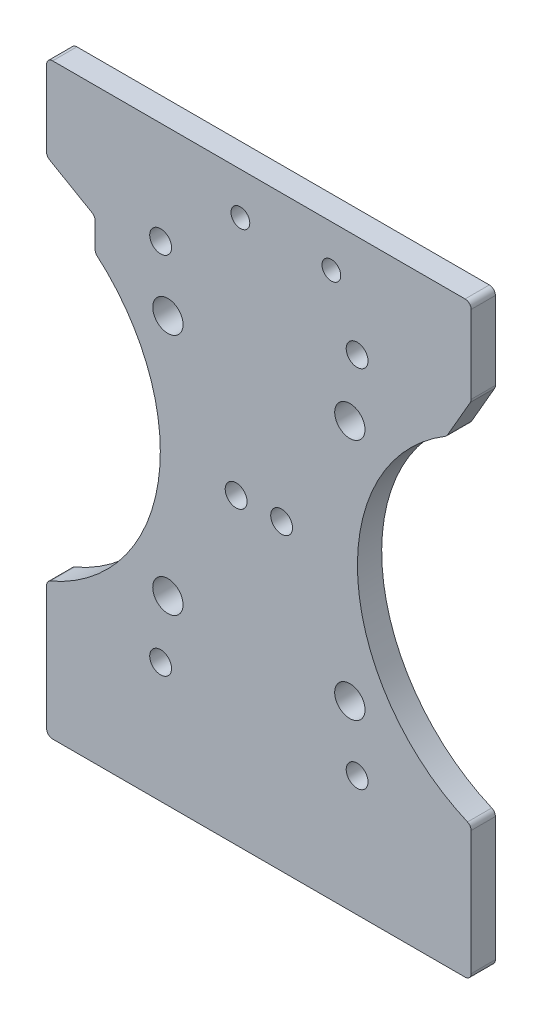
ISO-10303-21;
HEADER;
FILE_DESCRIPTION(('STEP AP214'),'2;1');
FILE_NAME('part.step','',(''),(''),'','','');
FILE_SCHEMA(('AUTOMOTIVE_DESIGN { 1 0 10303 214 1 1 1 1 }'));
ENDSEC;
DATA;
#1=APPLICATION_CONTEXT('core data for automotive mechanical design processes');
#2=APPLICATION_PROTOCOL_DEFINITION('international standard','automotive_design',2000,#1);
#3=PRODUCT_CONTEXT('',#1,'mechanical');
#4=PRODUCT('Part','Part','',(#3));
#5=PRODUCT_RELATED_PRODUCT_CATEGORY('part','',(#4));
#6=PRODUCT_DEFINITION_FORMATION('','',#4);
#7=PRODUCT_DEFINITION_CONTEXT('part definition',#1,'design');
#8=PRODUCT_DEFINITION('design','',#6,#7);
#9=PRODUCT_DEFINITION_SHAPE('','',#8);
#10=(LENGTH_UNIT() NAMED_UNIT(*) SI_UNIT(.MILLI.,.METRE.));
#11=(NAMED_UNIT(*) PLANE_ANGLE_UNIT() SI_UNIT($,.RADIAN.));
#12=(NAMED_UNIT(*) SI_UNIT($,.STERADIAN.) SOLID_ANGLE_UNIT());
#13=UNCERTAINTY_MEASURE_WITH_UNIT(LENGTH_MEASURE(1.E-05),#10,'distance_accuracy_value','');
#14=(GEOMETRIC_REPRESENTATION_CONTEXT(3) GLOBAL_UNCERTAINTY_ASSIGNED_CONTEXT((#13)) GLOBAL_UNIT_ASSIGNED_CONTEXT((#10,
#11,#12)) REPRESENTATION_CONTEXT('',''));
#15=CARTESIAN_POINT('',(0.,0.,0.));
#16=DIRECTION('',(0.,0.,1.));
#17=DIRECTION('',(1.,0.,0.));
#18=AXIS2_PLACEMENT_3D('',#15,#16,#17);
#19=CARTESIAN_POINT('',(46.25,0.,4.));
#20=DIRECTION('',(0.,0.,-1.));
#21=DIRECTION('',(-1.,0.,0.));
#22=AXIS2_PLACEMENT_3D('',#19,#20,#21);
#23=CYLINDRICAL_SURFACE('',#22,30.);
#24=CARTESIAN_POINT('',(46.25,0.,4.));
#25=DIRECTION('',(0.,0.,1.));
#26=DIRECTION('',(1.,0.,0.));
#27=AXIS2_PLACEMENT_3D('',#24,#25,#26);
#28=CIRCLE('',#27,30.);
#29=CARTESIAN_POINT('',(30.7389788384187,25.6789451209542,4.));
#30=VERTEX_POINT('',#29);
#31=CARTESIAN_POINT('',(34.3951612903231,-27.5583526207127,4.));
#32=VERTEX_POINT('',#31);
#33=EDGE_CURVE('E419',#30,#32,#28,.T.);
#34=ORIENTED_EDGE('',*,*,#33,.T.);
#35=DIRECTION('',(0.,0.,-1.));
#36=VECTOR('',#35,1.);
#37=CARTESIAN_POINT('',(34.3951612903231,-27.5583526207127,4.));
#38=LINE('',#37,#36);
#39=CARTESIAN_POINT('',(34.3951612903231,-27.5583526207127,0.));
#40=VERTEX_POINT('',#39);
#41=EDGE_CURVE('E210',#32,#40,#38,.T.);
#42=ORIENTED_EDGE('',*,*,#41,.T.);
#43=CARTESIAN_POINT('',(46.25,0.,0.));
#44=DIRECTION('',(0.,0.,1.));
#45=DIRECTION('',(1.,0.,0.));
#46=AXIS2_PLACEMENT_3D('',#43,#44,#45);
#47=CIRCLE('',#46,30.);
#48=CARTESIAN_POINT('',(30.7389788384187,25.6789451209542,0.));
#49=VERTEX_POINT('',#48);
#50=EDGE_CURVE('E194',#49,#40,#47,.T.);
#51=ORIENTED_EDGE('',*,*,#50,.F.);
#52=DIRECTION('',(0.,0.,-1.));
#53=VECTOR('',#52,1.);
#54=CARTESIAN_POINT('',(30.7389788384187,25.6789451209542,4.));
#55=LINE('',#54,#53);
#56=EDGE_CURVE('E207',#49,#30,#55,.F.);
#57=ORIENTED_EDGE('',*,*,#56,.T.);
#58=EDGE_LOOP('',(#34,#42,#51,#57));
#59=FACE_BOUND('',#58,.T.);
#60=ADVANCED_FACE('F40',(#59),#23,.F.);
#61=CARTESIAN_POINT('',(12.0425309480404,-6.9527584845755,4.));
#62=DIRECTION('',(0.866025403784439,-0.499999999999999,0.));
#63=DIRECTION('',(0.499999999999999,0.86602540378444,0.));
#64=AXIS2_PLACEMENT_3D('',#61,#62,#63);
#65=PLANE('',#64);
#66=DIRECTION('',(-0.499999999999999,-0.86602540378444,0.));
#67=VECTOR('',#66,1.);
#68=CARTESIAN_POINT('',(12.0425309480404,-6.9527584845755,4.));
#69=LINE('',#68,#67);
#70=CARTESIAN_POINT('',(34.8660254037845,32.57869351904,4.));
#71=VERTEX_POINT('',#70);
#72=CARTESIAN_POINT('',(31.0879702034838,26.0349099583193,4.));
#73=VERTEX_POINT('',#72);
#74=EDGE_CURVE('E421',#71,#73,#69,.T.);
#75=ORIENTED_EDGE('',*,*,#74,.T.);
#76=DIRECTION('',(0.,0.,-1.));
#77=VECTOR('',#76,1.);
#78=CARTESIAN_POINT('',(31.0879702034838,26.0349099583193,4.));
#79=LINE('',#78,#77);
#80=CARTESIAN_POINT('',(31.0879702034838,26.0349099583193,0.));
#81=VERTEX_POINT('',#80);
#82=EDGE_CURVE('E296',#73,#81,#79,.T.);
#83=ORIENTED_EDGE('',*,*,#82,.T.);
#84=DIRECTION('',(-0.499999999999999,-0.86602540378444,0.));
#85=VECTOR('',#84,1.);
#86=CARTESIAN_POINT('',(12.0425309480404,-6.9527584845755,0.));
#87=LINE('',#86,#85);
#88=CARTESIAN_POINT('',(34.8660254037845,32.57869351904,0.));
#89=VERTEX_POINT('',#88);
#90=EDGE_CURVE('E196',#89,#81,#87,.T.);
#91=ORIENTED_EDGE('',*,*,#90,.F.);
#92=DIRECTION('',(0.,0.,-1.));
#93=VECTOR('',#92,1.);
#94=CARTESIAN_POINT('',(34.8660254037845,32.57869351904,4.));
#95=LINE('',#94,#93);
#96=EDGE_CURVE('E294',#89,#71,#95,.F.);
#97=ORIENTED_EDGE('',*,*,#96,.T.);
#98=EDGE_LOOP('',(#75,#83,#91,#97));
#99=FACE_BOUND('',#98,.T.);
#100=ADVANCED_FACE('F461',(#99),#65,.T.);
#101=CARTESIAN_POINT('',(35.,0.,4.));
#102=DIRECTION('',(1.,0.,0.));
#103=DIRECTION('',(0.,1.,0.));
#104=AXIS2_PLACEMENT_3D('',#101,#102,#103);
#105=PLANE('',#104);
#106=DIRECTION('',(0.,-1.,0.));
#107=VECTOR('',#106,1.);
#108=CARTESIAN_POINT('',(35.,0.,4.));
#109=LINE('',#108,#107);
#110=CARTESIAN_POINT('',(35.0000000000001,45.9201449273124,4.));
#111=VERTEX_POINT('',#110);
#112=CARTESIAN_POINT('',(35.0000000000001,33.07869351904,4.));
#113=VERTEX_POINT('',#112);
#114=EDGE_CURVE('E424',#111,#113,#109,.T.);
#115=ORIENTED_EDGE('',*,*,#114,.T.);
#116=DIRECTION('',(0.,0.,-1.));
#117=VECTOR('',#116,1.);
#118=CARTESIAN_POINT('',(35.0000000000001,33.07869351904,4.));
#119=LINE('',#118,#117);
#120=CARTESIAN_POINT('',(35.0000000000001,33.07869351904,0.));
#121=VERTEX_POINT('',#120);
#122=EDGE_CURVE('E300',#113,#121,#119,.T.);
#123=ORIENTED_EDGE('',*,*,#122,.T.);
#124=DIRECTION('',(0.,-1.,0.));
#125=VECTOR('',#124,1.);
#126=CARTESIAN_POINT('',(35.,0.,0.));
#127=LINE('',#126,#125);
#128=CARTESIAN_POINT('',(35.0000000000001,45.9201449273124,0.));
#129=VERTEX_POINT('',#128);
#130=EDGE_CURVE('E371',#129,#121,#127,.T.);
#131=ORIENTED_EDGE('',*,*,#130,.F.);
#132=DIRECTION('',(0.,0.,-1.));
#133=VECTOR('',#132,1.);
#134=CARTESIAN_POINT('',(35.0000000000001,45.9201449273124,4.));
#135=LINE('',#134,#133);
#136=EDGE_CURVE('E298',#129,#111,#135,.F.);
#137=ORIENTED_EDGE('',*,*,#136,.T.);
#138=EDGE_LOOP('',(#115,#123,#131,#137));
#139=FACE_BOUND('',#138,.T.);
#140=ADVANCED_FACE('F453',(#139),#105,.T.);
#141=CARTESIAN_POINT('',(0.,46.9201449273124,4.));
#142=DIRECTION('',(0.,1.,0.));
#143=DIRECTION('',(0.,0.,1.));
#144=AXIS2_PLACEMENT_3D('',#141,#142,#143);
#145=PLANE('',#144);
#146=DIRECTION('',(1.,0.,0.));
#147=VECTOR('',#146,1.);
#148=CARTESIAN_POINT('',(0.,46.9201449273124,0.));
#149=LINE('',#148,#147);
#150=CARTESIAN_POINT('',(-34.,46.9201449273124,0.));
#151=VERTEX_POINT('',#150);
#152=CARTESIAN_POINT('',(34.0000000000001,46.9201449273124,0.));
#153=VERTEX_POINT('',#152);
#154=EDGE_CURVE('E374',#151,#153,#149,.T.);
#155=ORIENTED_EDGE('',*,*,#154,.F.);
#156=DIRECTION('',(0.,0.,-1.));
#157=VECTOR('',#156,1.);
#158=CARTESIAN_POINT('',(-34.,46.9201449273124,4.));
#159=LINE('',#158,#157);
#160=CARTESIAN_POINT('',(-34.,46.9201449273124,4.));
#161=VERTEX_POINT('',#160);
#162=EDGE_CURVE('E306',#151,#161,#159,.F.);
#163=ORIENTED_EDGE('',*,*,#162,.T.);
#164=DIRECTION('',(1.,0.,0.));
#165=VECTOR('',#164,1.);
#166=CARTESIAN_POINT('',(0.,46.9201449273124,4.));
#167=LINE('',#166,#165);
#168=CARTESIAN_POINT('',(34.0000000000001,46.9201449273124,4.));
#169=VERTEX_POINT('',#168);
#170=EDGE_CURVE('E427',#161,#169,#167,.T.);
#171=ORIENTED_EDGE('',*,*,#170,.T.);
#172=DIRECTION('',(0.,0.,-1.));
#173=VECTOR('',#172,1.);
#174=CARTESIAN_POINT('',(34.0000000000001,46.9201449273124,4.));
#175=LINE('',#174,#173);
#176=EDGE_CURVE('E303',#169,#153,#175,.T.);
#177=ORIENTED_EDGE('',*,*,#176,.T.);
#178=EDGE_LOOP('',(#155,#163,#171,#177));
#179=FACE_BOUND('',#178,.T.);
#180=ADVANCED_FACE('F446',(#179),#145,.T.);
#181=CARTESIAN_POINT('',(-35.,0.,4.));
#182=DIRECTION('',(1.,0.,0.));
#183=DIRECTION('',(0.,1.,0.));
#184=AXIS2_PLACEMENT_3D('',#181,#182,#183);
#185=PLANE('',#184);
#186=DIRECTION('',(0.,-1.,0.));
#187=VECTOR('',#186,1.);
#188=CARTESIAN_POINT('',(-35.,0.,0.));
#189=LINE('',#188,#187);
#190=CARTESIAN_POINT('',(-35.,45.9201449273124,0.));
#191=VERTEX_POINT('',#190);
#192=CARTESIAN_POINT('',(-35.,33.3880945957984,0.));
#193=VERTEX_POINT('',#192);
#194=EDGE_CURVE('E321',#191,#193,#189,.T.);
#195=ORIENTED_EDGE('',*,*,#194,.T.);
#196=DIRECTION('',(0.,0.,-1.));
#197=VECTOR('',#196,1.);
#198=CARTESIAN_POINT('',(-35.,33.3880945957984,4.));
#199=LINE('',#198,#197);
#200=CARTESIAN_POINT('',(-35.,33.3880945957984,4.));
#201=VERTEX_POINT('',#200);
#202=EDGE_CURVE('E292',#193,#201,#199,.F.);
#203=ORIENTED_EDGE('',*,*,#202,.T.);
#204=DIRECTION('',(0.,-1.,0.));
#205=VECTOR('',#204,1.);
#206=CARTESIAN_POINT('',(-35.,0.,4.));
#207=LINE('',#206,#205);
#208=CARTESIAN_POINT('',(-35.,45.9201449273124,4.));
#209=VERTEX_POINT('',#208);
#210=EDGE_CURVE('E341',#209,#201,#207,.T.);
#211=ORIENTED_EDGE('',*,*,#210,.F.);
#212=DIRECTION('',(0.,0.,-1.));
#213=VECTOR('',#212,1.);
#214=CARTESIAN_POINT('',(-35.,45.9201449273124,0.));
#215=LINE('',#214,#213);
#216=EDGE_CURVE('E289',#209,#191,#215,.T.);
#217=ORIENTED_EDGE('',*,*,#216,.T.);
#218=EDGE_LOOP('',(#195,#203,#211,#217));
#219=FACE_BOUND('',#218,.T.);
#220=ADVANCED_FACE('F440',(#219),#185,.F.);
#221=CARTESIAN_POINT('',(5.45746905195969,9.45261367872896,4.));
#222=DIRECTION('',(0.499999999999999,0.866025403784439,0.));
#223=DIRECTION('',(-0.866025403784439,0.499999999999999,0.));
#224=AXIS2_PLACEMENT_3D('',#221,#222,#223);
#225=PLANE('',#224);
#226=DIRECTION('',(0.86602540378444,-0.499999999999999,0.));
#227=VECTOR('',#226,1.);
#228=CARTESIAN_POINT('',(5.45746905195969,9.45261367872896,0.));
#229=LINE('',#228,#227);
#230=CARTESIAN_POINT('',(-34.5,32.522069192014,0.));
#231=VERTEX_POINT('',#230);
#232=CARTESIAN_POINT('',(-27.5,28.4806173076866,0.));
#233=VERTEX_POINT('',#232);
#234=EDGE_CURVE('E310',#231,#233,#229,.T.);
#235=ORIENTED_EDGE('',*,*,#234,.T.);
#236=DIRECTION('',(0.,0.,-1.));
#237=VECTOR('',#236,1.);
#238=CARTESIAN_POINT('',(-27.5,28.4806173076866,4.));
#239=LINE('',#238,#237);
#240=CARTESIAN_POINT('',(-27.5,28.4806173076866,4.));
#241=VERTEX_POINT('',#240);
#242=EDGE_CURVE('E287',#233,#241,#239,.F.);
#243=ORIENTED_EDGE('',*,*,#242,.T.);
#244=DIRECTION('',(0.86602540378444,-0.499999999999999,0.));
#245=VECTOR('',#244,1.);
#246=CARTESIAN_POINT('',(5.45746905195969,9.45261367872896,4.));
#247=LINE('',#246,#245);
#248=CARTESIAN_POINT('',(-34.5,32.522069192014,4.));
#249=VERTEX_POINT('',#248);
#250=EDGE_CURVE('E332',#249,#241,#247,.T.);
#251=ORIENTED_EDGE('',*,*,#250,.F.);
#252=DIRECTION('',(0.,0.,-1.));
#253=VECTOR('',#252,1.);
#254=CARTESIAN_POINT('',(-34.5,32.522069192014,4.));
#255=LINE('',#254,#253);
#256=EDGE_CURVE('E284',#249,#231,#255,.T.);
#257=ORIENTED_EDGE('',*,*,#256,.T.);
#258=EDGE_LOOP('',(#235,#243,#251,#257));
#259=FACE_BOUND('',#258,.T.);
#260=ADVANCED_FACE('F317',(#259),#225,.F.);
#261=CARTESIAN_POINT('',(-27.,0.,4.));
#262=DIRECTION('',(1.,0.,0.));
#263=DIRECTION('',(0.,1.,0.));
#264=AXIS2_PLACEMENT_3D('',#261,#262,#263);
#265=PLANE('',#264);
#266=DIRECTION('',(0.,-1.,0.));
#267=VECTOR('',#266,1.);
#268=CARTESIAN_POINT('',(-27.,0.,4.));
#269=LINE('',#268,#267);
#270=CARTESIAN_POINT('',(-27.,27.6145919039021,4.));
#271=VERTEX_POINT('',#270);
#272=CARTESIAN_POINT('',(-27.,23.4720578560978,4.));
#273=VERTEX_POINT('',#272);
#274=EDGE_CURVE('E330',#271,#273,#269,.T.);
#275=ORIENTED_EDGE('',*,*,#274,.F.);
#276=DIRECTION('',(0.,0.,-1.));
#277=VECTOR('',#276,1.);
#278=CARTESIAN_POINT('',(-27.,27.6145919039021,0.));
#279=LINE('',#278,#277);
#280=CARTESIAN_POINT('',(-27.,27.6145919039021,0.));
#281=VERTEX_POINT('',#280);
#282=EDGE_CURVE('E281',#271,#281,#279,.T.);
#283=ORIENTED_EDGE('',*,*,#282,.T.);
#284=DIRECTION('',(0.,-1.,0.));
#285=VECTOR('',#284,1.);
#286=CARTESIAN_POINT('',(-27.,0.,0.));
#287=LINE('',#286,#285);
#288=CARTESIAN_POINT('',(-27.,23.4720578560978,0.));
#289=VERTEX_POINT('',#288);
#290=EDGE_CURVE('E312',#281,#289,#287,.T.);
#291=ORIENTED_EDGE('',*,*,#290,.T.);
#292=DIRECTION('',(0.,0.,1.));
#293=VECTOR('',#292,1.);
#294=CARTESIAN_POINT('',(-27.,23.4720578560978,4.));
#295=LINE('',#294,#293);
#296=EDGE_CURVE('E279',#289,#273,#295,.T.);
#297=ORIENTED_EDGE('',*,*,#296,.T.);
#298=EDGE_LOOP('',(#275,#283,#291,#297));
#299=FACE_BOUND('',#298,.T.);
#300=ADVANCED_FACE('F334',(#299),#265,.F.);
#301=CARTESIAN_POINT('',(-46.25,0.,4.));
#302=DIRECTION('',(0.,0.,-1.));
#303=DIRECTION('',(-1.,0.,0.));
#304=AXIS2_PLACEMENT_3D('',#301,#302,#303);
#305=CYLINDRICAL_SURFACE('',#304,30.);
#306=CARTESIAN_POINT('',(-46.25,0.,0.));
#307=DIRECTION('',(0.,0.,1.));
#308=DIRECTION('',(1.,0.,0.));
#309=AXIS2_PLACEMENT_3D('',#306,#307,#308);
#310=CIRCLE('',#309,30.);
#311=CARTESIAN_POINT('',(-34.3951612903226,-27.5583526207126,0.));
#312=VERTEX_POINT('',#311);
#313=CARTESIAN_POINT('',(-26.6532258064516,22.7148946994494,0.));
#314=VERTEX_POINT('',#313);
#315=EDGE_CURVE('E380',#312,#314,#310,.T.);
#316=ORIENTED_EDGE('',*,*,#315,.F.);
#317=DIRECTION('',(0.,0.,-1.));
#318=VECTOR('',#317,1.);
#319=CARTESIAN_POINT('',(-34.3951612903226,-27.5583526207126,4.));
#320=LINE('',#319,#318);
#321=CARTESIAN_POINT('',(-34.3951612903226,-27.5583526207126,4.));
#322=VERTEX_POINT('',#321);
#323=EDGE_CURVE('E277',#312,#322,#320,.F.);
#324=ORIENTED_EDGE('',*,*,#323,.T.);
#325=CARTESIAN_POINT('',(-46.25,0.,4.));
#326=DIRECTION('',(0.,0.,1.));
#327=DIRECTION('',(1.,0.,0.));
#328=AXIS2_PLACEMENT_3D('',#325,#326,#327);
#329=CIRCLE('',#328,30.);
#330=CARTESIAN_POINT('',(-26.6532258064516,22.7148946994494,4.));
#331=VERTEX_POINT('',#330);
#332=EDGE_CURVE('E336',#322,#331,#329,.T.);
#333=ORIENTED_EDGE('',*,*,#332,.T.);
#334=DIRECTION('',(0.,0.,-1.));
#335=VECTOR('',#334,1.);
#336=CARTESIAN_POINT('',(-26.6532258064516,22.7148946994494,4.));
#337=LINE('',#336,#335);
#338=EDGE_CURVE('E274',#331,#314,#337,.T.);
#339=ORIENTED_EDGE('',*,*,#338,.T.);
#340=EDGE_LOOP('',(#316,#324,#333,#339));
#341=FACE_BOUND('',#340,.T.);
#342=ADVANCED_FACE('F492',(#341),#305,.F.);
#343=CARTESIAN_POINT('',(-35.,0.,4.));
#344=DIRECTION('',(1.,0.,0.));
#345=DIRECTION('',(0.,1.,0.));
#346=AXIS2_PLACEMENT_3D('',#343,#344,#345);
#347=PLANE('',#346);
#348=DIRECTION('',(0.,-1.,0.));
#349=VECTOR('',#348,1.);
#350=CARTESIAN_POINT('',(-35.,0.,0.));
#351=LINE('',#350,#349);
#352=CARTESIAN_POINT('',(-35.,-28.4769643747363,0.));
#353=VERTEX_POINT('',#352);
#354=CARTESIAN_POINT('',(-35.,-48.9201449273124,0.));
#355=VERTEX_POINT('',#354);
#356=EDGE_CURVE('E383',#353,#355,#351,.T.);
#357=ORIENTED_EDGE('',*,*,#356,.T.);
#358=DIRECTION('',(0.,0.,-1.));
#359=VECTOR('',#358,1.);
#360=CARTESIAN_POINT('',(-35.,-48.9201449273124,4.));
#361=LINE('',#360,#359);
#362=CARTESIAN_POINT('',(-35.,-48.9201449273124,4.));
#363=VERTEX_POINT('',#362);
#364=EDGE_CURVE('E272',#355,#363,#361,.F.);
#365=ORIENTED_EDGE('',*,*,#364,.T.);
#366=DIRECTION('',(0.,-1.,0.));
#367=VECTOR('',#366,1.);
#368=CARTESIAN_POINT('',(-35.,0.,4.));
#369=LINE('',#368,#367);
#370=CARTESIAN_POINT('',(-35.,-28.4769643747363,4.));
#371=VERTEX_POINT('',#370);
#372=EDGE_CURVE('E339',#371,#363,#369,.T.);
#373=ORIENTED_EDGE('',*,*,#372,.F.);
#374=DIRECTION('',(0.,0.,1.));
#375=VECTOR('',#374,1.);
#376=CARTESIAN_POINT('',(-35.,-28.4769643747363,0.));
#377=LINE('',#376,#375);
#378=EDGE_CURVE('E269',#371,#353,#377,.F.);
#379=ORIENTED_EDGE('',*,*,#378,.T.);
#380=EDGE_LOOP('',(#357,#365,#373,#379));
#381=FACE_BOUND('',#380,.T.);
#382=ADVANCED_FACE('F483',(#381),#347,.F.);
#383=CARTESIAN_POINT('',(0.,-49.9201449273124,4.));
#384=DIRECTION('',(0.,1.,0.));
#385=DIRECTION('',(-1.,0.,0.));
#386=AXIS2_PLACEMENT_3D('',#383,#384,#385);
#387=PLANE('',#386);
#388=DIRECTION('',(1.,0.,0.));
#389=VECTOR('',#388,1.);
#390=CARTESIAN_POINT('',(0.,-49.9201449273124,0.));
#391=LINE('',#390,#389);
#392=CARTESIAN_POINT('',(-34.,-49.9201449273124,0.));
#393=VERTEX_POINT('',#392);
#394=CARTESIAN_POINT('',(34.,-49.9201449273124,0.));
#395=VERTEX_POINT('',#394);
#396=EDGE_CURVE('E386',#393,#395,#391,.T.);
#397=ORIENTED_EDGE('',*,*,#396,.T.);
#398=DIRECTION('',(0.,0.,-1.));
#399=VECTOR('',#398,1.);
#400=CARTESIAN_POINT('',(34.,-49.9201449273124,4.));
#401=LINE('',#400,#399);
#402=CARTESIAN_POINT('',(34.,-49.9201449273124,4.));
#403=VERTEX_POINT('',#402);
#404=EDGE_CURVE('E55',#395,#403,#401,.F.);
#405=ORIENTED_EDGE('',*,*,#404,.T.);
#406=DIRECTION('',(1.,0.,0.));
#407=VECTOR('',#406,1.);
#408=CARTESIAN_POINT('',(0.,-49.9201449273124,4.));
#409=LINE('',#408,#407);
#410=CARTESIAN_POINT('',(-34.,-49.9201449273124,4.));
#411=VERTEX_POINT('',#410);
#412=EDGE_CURVE('E346',#411,#403,#409,.T.);
#413=ORIENTED_EDGE('',*,*,#412,.F.);
#414=DIRECTION('',(0.,0.,-1.));
#415=VECTOR('',#414,1.);
#416=CARTESIAN_POINT('',(-34.,-49.9201449273124,4.));
#417=LINE('',#416,#415);
#418=EDGE_CURVE('E265',#411,#393,#417,.T.);
#419=ORIENTED_EDGE('',*,*,#418,.T.);
#420=EDGE_LOOP('',(#397,#405,#413,#419));
#421=FACE_BOUND('',#420,.T.);
#422=ADVANCED_FACE('F476',(#421),#387,.F.);
#423=CARTESIAN_POINT('',(-3.05,40.,4.));
#424=DIRECTION('',(0.,0.,-1.));
#425=DIRECTION('',(-1.,0.,0.));
#426=AXIS2_PLACEMENT_3D('',#423,#424,#425);
#427=CYLINDRICAL_SURFACE('',#426,1.55);
#428=CARTESIAN_POINT('',(-3.05,40.,4.));
#429=DIRECTION('',(0.,0.,1.));
#430=DIRECTION('',(1.,0.,0.));
#431=AXIS2_PLACEMENT_3D('',#428,#429,#430);
#432=CIRCLE('',#431,1.55);
#433=CARTESIAN_POINT('',(-1.5,40.,4.));
#434=VERTEX_POINT('',#433);
#435=EDGE_CURVE('E221',#434,#434,#432,.T.);
#436=ORIENTED_EDGE('',*,*,#435,.T.);
#437=EDGE_LOOP('',(#436));
#438=FACE_BOUND('',#437,.T.);
#439=CARTESIAN_POINT('',(-3.05,40.,0.));
#440=DIRECTION('',(0.,0.,1.));
#441=DIRECTION('',(1.,0.,0.));
#442=AXIS2_PLACEMENT_3D('',#439,#440,#441);
#443=CIRCLE('',#442,1.55);
#444=CARTESIAN_POINT('',(-1.5,40.,0.));
#445=VERTEX_POINT('',#444);
#446=EDGE_CURVE('E390',#445,#445,#443,.T.);
#447=ORIENTED_EDGE('',*,*,#446,.F.);
#448=EDGE_LOOP('',(#447));
#449=FACE_BOUND('',#448,.T.);
#450=ADVANCED_FACE('F739',(#438,#449),#427,.F.);
#451=CARTESIAN_POINT('',(35.0000000000012,-8.09537622122536E-13,4.));
#452=DIRECTION('',(-1.,0.,0.));
#453=DIRECTION('',(0.,-1.,0.));
#454=AXIS2_PLACEMENT_3D('',#451,#452,#453);
#455=PLANE('',#454);
#456=DIRECTION('',(0.,1.,0.));
#457=VECTOR('',#456,1.);
#458=CARTESIAN_POINT('',(35.0000000000012,-8.09537622122536E-13,0.));
#459=LINE('',#458,#457);
#460=CARTESIAN_POINT('',(35.,-48.9201449273124,0.));
#461=VERTEX_POINT('',#460);
#462=CARTESIAN_POINT('',(35.0000000000005,-28.4769643747365,0.));
#463=VERTEX_POINT('',#462);
#464=EDGE_CURVE('E388',#461,#463,#459,.T.);
#465=ORIENTED_EDGE('',*,*,#464,.T.);
#466=DIRECTION('',(0.,0.,1.));
#467=VECTOR('',#466,1.);
#468=CARTESIAN_POINT('',(35.0000000000005,-28.4769643747365,4.));
#469=LINE('',#468,#467);
#470=CARTESIAN_POINT('',(35.0000000000005,-28.4769643747365,4.));
#471=VERTEX_POINT('',#470);
#472=EDGE_CURVE('E245',#463,#471,#469,.T.);
#473=ORIENTED_EDGE('',*,*,#472,.T.);
#474=DIRECTION('',(0.,1.,0.));
#475=VECTOR('',#474,1.);
#476=CARTESIAN_POINT('',(35.0000000000012,-8.09537622122536E-13,4.));
#477=LINE('',#476,#475);
#478=CARTESIAN_POINT('',(35.,-48.9201449273124,4.));
#479=VERTEX_POINT('',#478);
#480=EDGE_CURVE('E348',#479,#471,#477,.T.);
#481=ORIENTED_EDGE('',*,*,#480,.F.);
#482=DIRECTION('',(0.,0.,-1.));
#483=VECTOR('',#482,1.);
#484=CARTESIAN_POINT('',(35.,-48.9201449273124,4.));
#485=LINE('',#484,#483);
#486=EDGE_CURVE('E242',#479,#461,#485,.T.);
#487=ORIENTED_EDGE('',*,*,#486,.T.);
#488=EDGE_LOOP('',(#465,#473,#481,#487));
#489=FACE_BOUND('',#488,.T.);
#490=ADVANCED_FACE('F469',(#489),#455,.F.);
#491=CARTESIAN_POINT('',(3.75000000000001,0.,4.));
#492=DIRECTION('',(0.,0.,-1.));
#493=DIRECTION('',(-1.,0.,0.));
#494=AXIS2_PLACEMENT_3D('',#491,#492,#493);
#495=CYLINDRICAL_SURFACE('',#494,1.8);
#496=CARTESIAN_POINT('',(3.75000000000001,0.,4.));
#497=DIRECTION('',(0.,0.,1.));
#498=DIRECTION('',(1.,0.,0.));
#499=AXIS2_PLACEMENT_3D('',#496,#497,#498);
#500=CIRCLE('',#499,1.8);
#501=CARTESIAN_POINT('',(5.55000000000001,0.,4.));
#502=VERTEX_POINT('',#501);
#503=EDGE_CURVE('E416',#502,#502,#500,.F.);
#504=ORIENTED_EDGE('',*,*,#503,.F.);
#505=EDGE_LOOP('',(#504));
#506=FACE_BOUND('',#505,.T.);
#507=CARTESIAN_POINT('',(3.75000000000001,0.,0.));
#508=DIRECTION('',(0.,0.,1.));
#509=DIRECTION('',(1.,0.,0.));
#510=AXIS2_PLACEMENT_3D('',#507,#508,#509);
#511=CIRCLE('',#510,1.8);
#512=CARTESIAN_POINT('',(5.55000000000001,0.,0.));
#513=VERTEX_POINT('',#512);
#514=EDGE_CURVE('E211',#513,#513,#511,.F.);
#515=ORIENTED_EDGE('',*,*,#514,.T.);
#516=EDGE_LOOP('',(#515));
#517=FACE_BOUND('',#516,.T.);
#518=ADVANCED_FACE('F513',(#506,#517),#495,.F.);
#519=CARTESIAN_POINT('',(-3.74999999999998,0.,4.));
#520=DIRECTION('',(0.,0.,-1.));
#521=DIRECTION('',(-1.,0.,0.));
#522=AXIS2_PLACEMENT_3D('',#519,#520,#521);
#523=CYLINDRICAL_SURFACE('',#522,1.8);
#524=CARTESIAN_POINT('',(-3.74999999999998,0.,4.));
#525=DIRECTION('',(0.,0.,1.));
#526=DIRECTION('',(1.,0.,0.));
#527=AXIS2_PLACEMENT_3D('',#524,#525,#526);
#528=CIRCLE('',#527,1.8);
#529=CARTESIAN_POINT('',(-1.94999999999998,0.,4.));
#530=VERTEX_POINT('',#529);
#531=EDGE_CURVE('E413',#530,#530,#528,.T.);
#532=ORIENTED_EDGE('',*,*,#531,.T.);
#533=EDGE_LOOP('',(#532));
#534=FACE_BOUND('',#533,.T.);
#535=CARTESIAN_POINT('',(-3.74999999999998,0.,0.));
#536=DIRECTION('',(0.,0.,1.));
#537=DIRECTION('',(1.,0.,0.));
#538=AXIS2_PLACEMENT_3D('',#535,#536,#537);
#539=CIRCLE('',#538,1.8);
#540=CARTESIAN_POINT('',(-1.94999999999998,0.,0.));
#541=VERTEX_POINT('',#540);
#542=EDGE_CURVE('E365',#541,#541,#539,.T.);
#543=ORIENTED_EDGE('',*,*,#542,.F.);
#544=EDGE_LOOP('',(#543));
#545=FACE_BOUND('',#544,.T.);
#546=ADVANCED_FACE('F516',(#534,#545),#523,.F.);
#547=CARTESIAN_POINT('',(-16.1979617995718,30.0520382004283,4.));
#548=DIRECTION('',(0.,0.,-1.));
#549=DIRECTION('',(-1.,0.,0.));
#550=AXIS2_PLACEMENT_3D('',#547,#548,#549);
#551=CYLINDRICAL_SURFACE('',#550,1.8);
#552=CARTESIAN_POINT('',(-16.1979617995718,30.0520382004283,4.));
#553=DIRECTION('',(0.,0.,1.));
#554=DIRECTION('',(1.,0.,0.));
#555=AXIS2_PLACEMENT_3D('',#552,#553,#554);
#556=CIRCLE('',#555,1.8);
#557=CARTESIAN_POINT('',(-14.3979617995718,30.0520382004283,4.));
#558=VERTEX_POINT('',#557);
#559=EDGE_CURVE('E410',#558,#558,#556,.T.);
#560=ORIENTED_EDGE('',*,*,#559,.T.);
#561=EDGE_LOOP('',(#560));
#562=FACE_BOUND('',#561,.T.);
#563=CARTESIAN_POINT('',(-16.1979617995718,30.0520382004283,0.));
#564=DIRECTION('',(0.,0.,1.));
#565=DIRECTION('',(1.,0.,0.));
#566=AXIS2_PLACEMENT_3D('',#563,#564,#565);
#567=CIRCLE('',#566,1.8);
#568=CARTESIAN_POINT('',(-14.3979617995718,30.0520382004283,0.));
#569=VERTEX_POINT('',#568);
#570=EDGE_CURVE('E362',#569,#569,#567,.T.);
#571=ORIENTED_EDGE('',*,*,#570,.F.);
#572=EDGE_LOOP('',(#571));
#573=FACE_BOUND('',#572,.T.);
#574=ADVANCED_FACE('F520',(#562,#573),#551,.F.);
#575=CARTESIAN_POINT('',(-16.1979617995718,-30.0520382004283,4.));
#576=DIRECTION('',(0.,0.,-1.));
#577=DIRECTION('',(-1.,0.,0.));
#578=AXIS2_PLACEMENT_3D('',#575,#576,#577);
#579=CYLINDRICAL_SURFACE('',#578,1.8);
#580=CARTESIAN_POINT('',(-16.1979617995718,-30.0520382004283,4.));
#581=DIRECTION('',(0.,0.,1.));
#582=DIRECTION('',(1.,0.,0.));
#583=AXIS2_PLACEMENT_3D('',#580,#581,#582);
#584=CIRCLE('',#583,1.8);
#585=CARTESIAN_POINT('',(-14.3979617995718,-30.0520382004283,4.));
#586=VERTEX_POINT('',#585);
#587=EDGE_CURVE('E403',#586,#586,#584,.T.);
#588=ORIENTED_EDGE('',*,*,#587,.T.);
#589=EDGE_LOOP('',(#588));
#590=FACE_BOUND('',#589,.T.);
#591=CARTESIAN_POINT('',(-16.1979617995718,-30.0520382004283,0.));
#592=DIRECTION('',(0.,0.,1.));
#593=DIRECTION('',(1.,0.,0.));
#594=AXIS2_PLACEMENT_3D('',#591,#592,#593);
#595=CIRCLE('',#594,1.8);
#596=CARTESIAN_POINT('',(-14.3979617995718,-30.0520382004283,0.));
#597=VERTEX_POINT('',#596);
#598=EDGE_CURVE('E359',#597,#597,#595,.T.);
#599=ORIENTED_EDGE('',*,*,#598,.F.);
#600=EDGE_LOOP('',(#599));
#601=FACE_BOUND('',#600,.T.);
#602=ADVANCED_FACE('F524',(#590,#601),#579,.F.);
#603=CARTESIAN_POINT('',(16.1979617995718,-30.0520382004283,4.));
#604=DIRECTION('',(0.,0.,-1.));
#605=DIRECTION('',(-1.,0.,0.));
#606=AXIS2_PLACEMENT_3D('',#603,#604,#605);
#607=CYLINDRICAL_SURFACE('',#606,1.8);
#608=CARTESIAN_POINT('',(16.1979617995718,-30.0520382004283,4.));
#609=DIRECTION('',(0.,0.,1.));
#610=DIRECTION('',(1.,0.,0.));
#611=AXIS2_PLACEMENT_3D('',#608,#609,#610);
#612=CIRCLE('',#611,1.8);
#613=CARTESIAN_POINT('',(17.9979617995718,-30.0520382004283,4.));
#614=VERTEX_POINT('',#613);
#615=EDGE_CURVE('E398',#614,#614,#612,.F.);
#616=ORIENTED_EDGE('',*,*,#615,.F.);
#617=EDGE_LOOP('',(#616));
#618=FACE_BOUND('',#617,.T.);
#619=CARTESIAN_POINT('',(16.1979617995718,-30.0520382004283,0.));
#620=DIRECTION('',(0.,0.,1.));
#621=DIRECTION('',(1.,0.,0.));
#622=AXIS2_PLACEMENT_3D('',#619,#620,#621);
#623=CIRCLE('',#622,1.8);
#624=CARTESIAN_POINT('',(17.9979617995718,-30.0520382004283,0.));
#625=VERTEX_POINT('',#624);
#626=EDGE_CURVE('E355',#625,#625,#623,.F.);
#627=ORIENTED_EDGE('',*,*,#626,.T.);
#628=EDGE_LOOP('',(#627));
#629=FACE_BOUND('',#628,.T.);
#630=ADVANCED_FACE('F528',(#618,#629),#607,.F.);
#631=CARTESIAN_POINT('',(16.1979617995718,30.0520382004283,4.));
#632=DIRECTION('',(0.,0.,-1.));
#633=DIRECTION('',(-1.,0.,0.));
#634=AXIS2_PLACEMENT_3D('',#631,#632,#633);
#635=CYLINDRICAL_SURFACE('',#634,1.8);
#636=CARTESIAN_POINT('',(16.1979617995718,30.0520382004283,4.));
#637=DIRECTION('',(0.,0.,1.));
#638=DIRECTION('',(1.,0.,0.));
#639=AXIS2_PLACEMENT_3D('',#636,#637,#638);
#640=CIRCLE('',#639,1.8);
#641=CARTESIAN_POINT('',(17.9979617995718,30.0520382004283,4.));
#642=VERTEX_POINT('',#641);
#643=EDGE_CURVE('E394',#642,#642,#640,.F.);
#644=ORIENTED_EDGE('',*,*,#643,.F.);
#645=EDGE_LOOP('',(#644));
#646=FACE_BOUND('',#645,.T.);
#647=CARTESIAN_POINT('',(16.1979617995718,30.0520382004283,0.));
#648=DIRECTION('',(0.,0.,1.));
#649=DIRECTION('',(1.,0.,0.));
#650=AXIS2_PLACEMENT_3D('',#647,#648,#649);
#651=CIRCLE('',#650,1.8);
#652=CARTESIAN_POINT('',(17.9979617995718,30.0520382004283,0.));
#653=VERTEX_POINT('',#652);
#654=EDGE_CURVE('E352',#653,#653,#651,.F.);
#655=ORIENTED_EDGE('',*,*,#654,.T.);
#656=EDGE_LOOP('',(#655));
#657=FACE_BOUND('',#656,.T.);
#658=ADVANCED_FACE('F532',(#646,#657),#635,.F.);
#659=CARTESIAN_POINT('',(11.95,40.,4.));
#660=DIRECTION('',(0.,0.,-1.));
#661=DIRECTION('',(-1.,0.,0.));
#662=AXIS2_PLACEMENT_3D('',#659,#660,#661);
#663=CYLINDRICAL_SURFACE('',#662,1.55);
#664=CARTESIAN_POINT('',(11.95,40.,4.));
#665=DIRECTION('',(0.,0.,1.));
#666=DIRECTION('',(1.,0.,0.));
#667=AXIS2_PLACEMENT_3D('',#664,#665,#666);
#668=CIRCLE('',#667,1.55);
#669=CARTESIAN_POINT('',(13.5,40.,4.));
#670=VERTEX_POINT('',#669);
#671=EDGE_CURVE('E216',#670,#670,#668,.F.);
#672=ORIENTED_EDGE('',*,*,#671,.F.);
#673=EDGE_LOOP('',(#672));
#674=FACE_BOUND('',#673,.T.);
#675=CARTESIAN_POINT('',(11.95,40.,0.));
#676=DIRECTION('',(0.,0.,1.));
#677=DIRECTION('',(1.,0.,0.));
#678=AXIS2_PLACEMENT_3D('',#675,#676,#677);
#679=CIRCLE('',#678,1.55);
#680=CARTESIAN_POINT('',(13.5,40.,0.));
#681=VERTEX_POINT('',#680);
#682=EDGE_CURVE('E224',#681,#681,#679,.F.);
#683=ORIENTED_EDGE('',*,*,#682,.T.);
#684=EDGE_LOOP('',(#683));
#685=FACE_BOUND('',#684,.T.);
#686=ADVANCED_FACE('F536',(#674,#685),#663,.F.);
#687=CARTESIAN_POINT('',(0.,0.,4.));
#688=DIRECTION('',(0.,0.,1.));
#689=DIRECTION('',(1.,0.,0.));
#690=AXIS2_PLACEMENT_3D('',#687,#688,#689);
#691=PLANE('',#690);
#692=CARTESIAN_POINT('',(15.,-20.,4.));
#693=DIRECTION('',(0.,0.,1.));
#694=DIRECTION('',(1.,0.,0.));
#695=AXIS2_PLACEMENT_3D('',#692,#693,#694);
#696=CIRCLE('',#695,2.5);
#697=CARTESIAN_POINT('',(17.5,-20.,4.));
#698=VERTEX_POINT('',#697);
#699=EDGE_CURVE('E356',#698,#698,#696,.T.);
#700=ORIENTED_EDGE('',*,*,#699,.F.);
#701=EDGE_LOOP('',(#700));
#702=FACE_BOUND('',#701,.T.);
#703=CARTESIAN_POINT('',(-14.9999999999999,-20.,4.));
#704=DIRECTION('',(0.,0.,1.));
#705=DIRECTION('',(1.,0.,0.));
#706=AXIS2_PLACEMENT_3D('',#703,#704,#705);
#707=CIRCLE('',#706,2.5);
#708=CARTESIAN_POINT('',(-12.4999999999999,-20.,4.));
#709=VERTEX_POINT('',#708);
#710=EDGE_CURVE('E903',#709,#709,#707,.T.);
#711=ORIENTED_EDGE('',*,*,#710,.F.);
#712=EDGE_LOOP('',(#711));
#713=FACE_BOUND('',#712,.T.);
#714=CARTESIAN_POINT('',(-15.,20.,4.));
#715=DIRECTION('',(0.,0.,1.));
#716=DIRECTION('',(1.,0.,0.));
#717=AXIS2_PLACEMENT_3D('',#714,#715,#716);
#718=CIRCLE('',#717,2.5);
#719=CARTESIAN_POINT('',(-12.5,20.,4.));
#720=VERTEX_POINT('',#719);
#721=EDGE_CURVE('E907',#720,#720,#718,.T.);
#722=ORIENTED_EDGE('',*,*,#721,.F.);
#723=EDGE_LOOP('',(#722));
#724=FACE_BOUND('',#723,.T.);
#725=CARTESIAN_POINT('',(15.,20.,4.));
#726=DIRECTION('',(0.,0.,1.));
#727=DIRECTION('',(1.,0.,0.));
#728=AXIS2_PLACEMENT_3D('',#725,#726,#727);
#729=CIRCLE('',#728,2.5);
#730=CARTESIAN_POINT('',(17.5,20.,4.));
#731=VERTEX_POINT('',#730);
#732=EDGE_CURVE('E910',#731,#731,#729,.T.);
#733=ORIENTED_EDGE('',*,*,#732,.F.);
#734=EDGE_LOOP('',(#733));
#735=FACE_BOUND('',#734,.T.);
#736=ORIENTED_EDGE('',*,*,#643,.T.);
#737=EDGE_LOOP('',(#736));
#738=FACE_BOUND('',#737,.T.);
#739=ORIENTED_EDGE('',*,*,#615,.T.);
#740=EDGE_LOOP('',(#739));
#741=FACE_BOUND('',#740,.T.);
#742=ORIENTED_EDGE('',*,*,#587,.F.);
#743=EDGE_LOOP('',(#742));
#744=FACE_BOUND('',#743,.T.);
#745=ORIENTED_EDGE('',*,*,#559,.F.);
#746=EDGE_LOOP('',(#745));
#747=FACE_BOUND('',#746,.T.);
#748=ORIENTED_EDGE('',*,*,#531,.F.);
#749=EDGE_LOOP('',(#748));
#750=FACE_BOUND('',#749,.T.);
#751=ORIENTED_EDGE('',*,*,#503,.T.);
#752=EDGE_LOOP('',(#751));
#753=FACE_BOUND('',#752,.T.);
#754=ORIENTED_EDGE('',*,*,#480,.T.);
#755=CARTESIAN_POINT('',(34.0000000000005,-28.4769643747365,4.));
#756=DIRECTION('',(0.,0.,1.));
#757=DIRECTION('',(1.,0.,0.));
#758=AXIS2_PLACEMENT_3D('',#755,#756,#757);
#759=CIRCLE('',#758,1.);
#760=EDGE_CURVE('E263',#471,#32,#759,.T.);
#761=ORIENTED_EDGE('',*,*,#760,.T.);
#762=ORIENTED_EDGE('',*,*,#33,.F.);
#763=CARTESIAN_POINT('',(30.2219447996993,26.5349099583193,4.));
#764=DIRECTION('',(0.,0.,1.));
#765=DIRECTION('',(1.,0.,0.));
#766=AXIS2_PLACEMENT_3D('',#763,#764,#765);
#767=CIRCLE('',#766,1.);
#768=EDGE_CURVE('E215',#30,#73,#767,.T.);
#769=ORIENTED_EDGE('',*,*,#768,.T.);
#770=ORIENTED_EDGE('',*,*,#74,.F.);
#771=CARTESIAN_POINT('',(34.0000000000001,33.07869351904,4.));
#772=DIRECTION('',(0.,0.,1.));
#773=DIRECTION('',(1.,0.,0.));
#774=AXIS2_PLACEMENT_3D('',#771,#772,#773);
#775=CIRCLE('',#774,1.);
#776=EDGE_CURVE('E251',#71,#113,#775,.T.);
#777=ORIENTED_EDGE('',*,*,#776,.T.);
#778=ORIENTED_EDGE('',*,*,#114,.F.);
#779=CARTESIAN_POINT('',(34.0000000000001,45.9201449273124,4.));
#780=DIRECTION('',(0.,0.,1.));
#781=DIRECTION('',(1.,0.,0.));
#782=AXIS2_PLACEMENT_3D('',#779,#780,#781);
#783=CIRCLE('',#782,1.);
#784=EDGE_CURVE('E247',#111,#169,#783,.T.);
#785=ORIENTED_EDGE('',*,*,#784,.T.);
#786=ORIENTED_EDGE('',*,*,#170,.F.);
#787=CARTESIAN_POINT('',(-34.,45.9201449273124,4.));
#788=DIRECTION('',(0.,0.,1.));
#789=DIRECTION('',(1.,0.,0.));
#790=AXIS2_PLACEMENT_3D('',#787,#788,#789);
#791=CIRCLE('',#790,1.);
#792=EDGE_CURVE('E249',#161,#209,#791,.T.);
#793=ORIENTED_EDGE('',*,*,#792,.T.);
#794=ORIENTED_EDGE('',*,*,#210,.T.);
#795=CARTESIAN_POINT('',(-34.,33.3880945957984,4.));
#796=DIRECTION('',(0.,0.,1.));
#797=DIRECTION('',(1.,0.,0.));
#798=AXIS2_PLACEMENT_3D('',#795,#796,#797);
#799=CIRCLE('',#798,1.);
#800=EDGE_CURVE('E256',#201,#249,#799,.T.);
#801=ORIENTED_EDGE('',*,*,#800,.T.);
#802=ORIENTED_EDGE('',*,*,#250,.T.);
#803=CARTESIAN_POINT('',(-28.,27.6145919039021,4.));
#804=DIRECTION('',(0.,0.,1.));
#805=DIRECTION('',(1.,0.,0.));
#806=AXIS2_PLACEMENT_3D('',#803,#804,#805);
#807=CIRCLE('',#806,1.);
#808=EDGE_CURVE('E11',#241,#271,#807,.F.);
#809=ORIENTED_EDGE('',*,*,#808,.T.);
#810=ORIENTED_EDGE('',*,*,#274,.T.);
#811=CARTESIAN_POINT('',(-26.,23.4720578560978,4.));
#812=DIRECTION('',(0.,0.,1.));
#813=DIRECTION('',(1.,0.,0.));
#814=AXIS2_PLACEMENT_3D('',#811,#812,#813);
#815=CIRCLE('',#814,1.);
#816=EDGE_CURVE('E254',#273,#331,#815,.T.);
#817=ORIENTED_EDGE('',*,*,#816,.T.);
#818=ORIENTED_EDGE('',*,*,#332,.F.);
#819=CARTESIAN_POINT('',(-34.,-28.4769643747363,4.));
#820=DIRECTION('',(0.,0.,1.));
#821=DIRECTION('',(1.,0.,0.));
#822=AXIS2_PLACEMENT_3D('',#819,#820,#821);
#823=CIRCLE('',#822,1.);
#824=EDGE_CURVE('E258',#322,#371,#823,.T.);
#825=ORIENTED_EDGE('',*,*,#824,.T.);
#826=ORIENTED_EDGE('',*,*,#372,.T.);
#827=CARTESIAN_POINT('',(-34.,-48.9201449273124,4.));
#828=DIRECTION('',(0.,0.,1.));
#829=DIRECTION('',(1.,0.,0.));
#830=AXIS2_PLACEMENT_3D('',#827,#828,#829);
#831=CIRCLE('',#830,1.);
#832=EDGE_CURVE('E62',#363,#411,#831,.T.);
#833=ORIENTED_EDGE('',*,*,#832,.T.);
#834=ORIENTED_EDGE('',*,*,#412,.T.);
#835=CARTESIAN_POINT('',(34.,-48.9201449273124,4.));
#836=DIRECTION('',(0.,0.,1.));
#837=DIRECTION('',(1.,0.,0.));
#838=AXIS2_PLACEMENT_3D('',#835,#836,#837);
#839=CIRCLE('',#838,1.);
#840=EDGE_CURVE('E261',#403,#479,#839,.T.);
#841=ORIENTED_EDGE('',*,*,#840,.T.);
#842=EDGE_LOOP('',(#754,#761,#762,#769,#770,#777,#778,#785,#786,#793,#794,#801,#802,#809,#810,
#817,#818,#825,#826,#833,#834,#841));
#843=FACE_BOUND('',#842,.T.);
#844=ORIENTED_EDGE('',*,*,#435,.F.);
#845=EDGE_LOOP('',(#844));
#846=FACE_BOUND('',#845,.T.);
#847=ORIENTED_EDGE('',*,*,#671,.T.);
#848=EDGE_LOOP('',(#847));
#849=FACE_BOUND('',#848,.T.);
#850=ADVANCED_FACE('F328',(#702,#713,#724,#735,#738,#741,#744,#747,#750,#753,#843,#846,#849),
#691,.T.);
#851=CARTESIAN_POINT('',(0.,0.,0.));
#852=DIRECTION('',(0.,0.,1.));
#853=DIRECTION('',(1.,0.,0.));
#854=AXIS2_PLACEMENT_3D('',#851,#852,#853);
#855=PLANE('',#854);
#856=CARTESIAN_POINT('',(15.,-20.,0.));
#857=DIRECTION('',(0.,0.,-1.));
#858=DIRECTION('',(1.,0.,0.));
#859=AXIS2_PLACEMENT_3D('',#856,#857,#858);
#860=CIRCLE('',#859,2.5);
#861=CARTESIAN_POINT('',(17.5,-20.,0.));
#862=VERTEX_POINT('',#861);
#863=EDGE_CURVE('E946',#862,#862,#860,.T.);
#864=ORIENTED_EDGE('',*,*,#863,.F.);
#865=EDGE_LOOP('',(#864));
#866=FACE_BOUND('',#865,.T.);
#867=CARTESIAN_POINT('',(-14.9999999999999,-20.,0.));
#868=DIRECTION('',(0.,0.,-1.));
#869=DIRECTION('',(-1.,0.,0.));
#870=AXIS2_PLACEMENT_3D('',#867,#868,#869);
#871=CIRCLE('',#870,2.5);
#872=CARTESIAN_POINT('',(-17.4999999999999,-20.,0.));
#873=VERTEX_POINT('',#872);
#874=EDGE_CURVE('E947',#873,#873,#871,.T.);
#875=ORIENTED_EDGE('',*,*,#874,.F.);
#876=EDGE_LOOP('',(#875));
#877=FACE_BOUND('',#876,.T.);
#878=CARTESIAN_POINT('',(-15.,20.,0.));
#879=DIRECTION('',(0.,0.,-1.));
#880=DIRECTION('',(1.,0.,0.));
#881=AXIS2_PLACEMENT_3D('',#878,#879,#880);
#882=CIRCLE('',#881,2.5);
#883=CARTESIAN_POINT('',(-12.5,20.,0.));
#884=VERTEX_POINT('',#883);
#885=EDGE_CURVE('E940',#884,#884,#882,.T.);
#886=ORIENTED_EDGE('',*,*,#885,.F.);
#887=EDGE_LOOP('',(#886));
#888=FACE_BOUND('',#887,.T.);
#889=CARTESIAN_POINT('',(15.,20.,0.));
#890=DIRECTION('',(0.,0.,-1.));
#891=DIRECTION('',(-1.,0.,0.));
#892=AXIS2_PLACEMENT_3D('',#889,#890,#891);
#893=CIRCLE('',#892,2.5);
#894=CARTESIAN_POINT('',(12.5,20.,0.));
#895=VERTEX_POINT('',#894);
#896=EDGE_CURVE('E936',#895,#895,#893,.T.);
#897=ORIENTED_EDGE('',*,*,#896,.F.);
#898=EDGE_LOOP('',(#897));
#899=FACE_BOUND('',#898,.T.);
#900=ORIENTED_EDGE('',*,*,#654,.F.);
#901=EDGE_LOOP('',(#900));
#902=FACE_BOUND('',#901,.T.);
#903=ORIENTED_EDGE('',*,*,#626,.F.);
#904=EDGE_LOOP('',(#903));
#905=FACE_BOUND('',#904,.T.);
#906=ORIENTED_EDGE('',*,*,#598,.T.);
#907=EDGE_LOOP('',(#906));
#908=FACE_BOUND('',#907,.T.);
#909=ORIENTED_EDGE('',*,*,#570,.T.);
#910=EDGE_LOOP('',(#909));
#911=FACE_BOUND('',#910,.T.);
#912=ORIENTED_EDGE('',*,*,#542,.T.);
#913=EDGE_LOOP('',(#912));
#914=FACE_BOUND('',#913,.T.);
#915=ORIENTED_EDGE('',*,*,#514,.F.);
#916=EDGE_LOOP('',(#915));
#917=FACE_BOUND('',#916,.T.);
#918=ORIENTED_EDGE('',*,*,#50,.T.);
#919=CARTESIAN_POINT('',(34.0000000000005,-28.4769643747365,0.));
#920=DIRECTION('',(0.,0.,1.));
#921=DIRECTION('',(1.,0.,0.));
#922=AXIS2_PLACEMENT_3D('',#919,#920,#921);
#923=CIRCLE('',#922,1.);
#924=EDGE_CURVE('E240',#40,#463,#923,.F.);
#925=ORIENTED_EDGE('',*,*,#924,.T.);
#926=ORIENTED_EDGE('',*,*,#464,.F.);
#927=CARTESIAN_POINT('',(34.,-48.9201449273124,0.));
#928=DIRECTION('',(0.,0.,1.));
#929=DIRECTION('',(1.,0.,0.));
#930=AXIS2_PLACEMENT_3D('',#927,#928,#929);
#931=CIRCLE('',#930,1.);
#932=EDGE_CURVE('E238',#461,#395,#931,.F.);
#933=ORIENTED_EDGE('',*,*,#932,.T.);
#934=ORIENTED_EDGE('',*,*,#396,.F.);
#935=CARTESIAN_POINT('',(-34.,-48.9201449273124,0.));
#936=DIRECTION('',(0.,0.,1.));
#937=DIRECTION('',(1.,0.,0.));
#938=AXIS2_PLACEMENT_3D('',#935,#936,#937);
#939=CIRCLE('',#938,1.);
#940=EDGE_CURVE('E236',#393,#355,#939,.F.);
#941=ORIENTED_EDGE('',*,*,#940,.T.);
#942=ORIENTED_EDGE('',*,*,#356,.F.);
#943=CARTESIAN_POINT('',(-34.,-28.4769643747363,0.));
#944=DIRECTION('',(0.,0.,1.));
#945=DIRECTION('',(1.,0.,0.));
#946=AXIS2_PLACEMENT_3D('',#943,#944,#945);
#947=CIRCLE('',#946,1.);
#948=EDGE_CURVE('E234',#353,#312,#947,.F.);
#949=ORIENTED_EDGE('',*,*,#948,.T.);
#950=ORIENTED_EDGE('',*,*,#315,.T.);
#951=CARTESIAN_POINT('',(-26.,23.4720578560978,0.));
#952=DIRECTION('',(0.,0.,1.));
#953=DIRECTION('',(1.,0.,0.));
#954=AXIS2_PLACEMENT_3D('',#951,#952,#953);
#955=CIRCLE('',#954,1.);
#956=EDGE_CURVE('E201',#314,#289,#955,.F.);
#957=ORIENTED_EDGE('',*,*,#956,.T.);
#958=ORIENTED_EDGE('',*,*,#290,.F.);
#959=CARTESIAN_POINT('',(-28.,27.6145919039021,0.));
#960=DIRECTION('',(0.,0.,1.));
#961=DIRECTION('',(1.,0.,0.));
#962=AXIS2_PLACEMENT_3D('',#959,#960,#961);
#963=CIRCLE('',#962,1.);
#964=EDGE_CURVE('E48',#281,#233,#963,.T.);
#965=ORIENTED_EDGE('',*,*,#964,.T.);
#966=ORIENTED_EDGE('',*,*,#234,.F.);
#967=CARTESIAN_POINT('',(-34.,33.3880945957984,0.));
#968=DIRECTION('',(0.,0.,1.));
#969=DIRECTION('',(1.,0.,0.));
#970=AXIS2_PLACEMENT_3D('',#967,#968,#969);
#971=CIRCLE('',#970,1.);
#972=EDGE_CURVE('E232',#231,#193,#971,.F.);
#973=ORIENTED_EDGE('',*,*,#972,.T.);
#974=ORIENTED_EDGE('',*,*,#194,.F.);
#975=CARTESIAN_POINT('',(-34.,45.9201449273124,0.));
#976=DIRECTION('',(0.,0.,1.));
#977=DIRECTION('',(1.,0.,0.));
#978=AXIS2_PLACEMENT_3D('',#975,#976,#977);
#979=CIRCLE('',#978,1.);
#980=EDGE_CURVE('E228',#191,#151,#979,.F.);
#981=ORIENTED_EDGE('',*,*,#980,.T.);
#982=ORIENTED_EDGE('',*,*,#154,.T.);
#983=CARTESIAN_POINT('',(34.0000000000001,45.9201449273124,0.));
#984=DIRECTION('',(0.,0.,1.));
#985=DIRECTION('',(1.,0.,0.));
#986=AXIS2_PLACEMENT_3D('',#983,#984,#985);
#987=CIRCLE('',#986,1.);
#988=EDGE_CURVE('E218',#153,#129,#987,.F.);
#989=ORIENTED_EDGE('',*,*,#988,.T.);
#990=ORIENTED_EDGE('',*,*,#130,.T.);
#991=CARTESIAN_POINT('',(34.0000000000001,33.07869351904,0.));
#992=DIRECTION('',(0.,0.,1.));
#993=DIRECTION('',(1.,0.,0.));
#994=AXIS2_PLACEMENT_3D('',#991,#992,#993);
#995=CIRCLE('',#994,1.);
#996=EDGE_CURVE('E202',#121,#89,#995,.F.);
#997=ORIENTED_EDGE('',*,*,#996,.T.);
#998=ORIENTED_EDGE('',*,*,#90,.T.);
#999=CARTESIAN_POINT('',(30.2219447996993,26.5349099583193,0.));
#1000=DIRECTION('',(0.,0.,1.));
#1001=DIRECTION('',(1.,0.,0.));
#1002=AXIS2_PLACEMENT_3D('',#999,#1000,#1001);
#1003=CIRCLE('',#1002,1.);
#1004=EDGE_CURVE('E190',#81,#49,#1003,.F.);
#1005=ORIENTED_EDGE('',*,*,#1004,.T.);
#1006=EDGE_LOOP('',(#918,#925,#926,#933,#934,#941,#942,#949,#950,#957,#958,#965,#966,#973,#974,
#981,#982,#989,#990,#997,#998,#1005));
#1007=FACE_BOUND('',#1006,.T.);
#1008=ORIENTED_EDGE('',*,*,#446,.T.);
#1009=EDGE_LOOP('',(#1008));
#1010=FACE_BOUND('',#1009,.T.);
#1011=ORIENTED_EDGE('',*,*,#682,.F.);
#1012=EDGE_LOOP('',(#1011));
#1013=FACE_BOUND('',#1012,.T.);
#1014=ADVANCED_FACE('F192',(#866,#877,#888,#899,#902,#905,#908,#911,#914,#917,#1007,#1010,
#1013),#855,.F.);
#1015=CARTESIAN_POINT('',(15.,20.,10.));
#1016=DIRECTION('',(0.,0.,-1.));
#1017=DIRECTION('',(-1.,0.,0.));
#1018=AXIS2_PLACEMENT_3D('',#1015,#1016,#1017);
#1019=CYLINDRICAL_SURFACE('',#1018,2.5);
#1020=ORIENTED_EDGE('',*,*,#732,.T.);
#1021=EDGE_LOOP('',(#1020));
#1022=FACE_BOUND('',#1021,.T.);
#1023=ORIENTED_EDGE('',*,*,#896,.T.);
#1024=EDGE_LOOP('',(#1023));
#1025=FACE_BOUND('',#1024,.T.);
#1026=ADVANCED_FACE('F656',(#1022,#1025),#1019,.F.);
#1027=CARTESIAN_POINT('',(-15.,20.,10.));
#1028=DIRECTION('',(0.,0.,-1.));
#1029=DIRECTION('',(-1.,0.,0.));
#1030=AXIS2_PLACEMENT_3D('',#1027,#1028,#1029);
#1031=CYLINDRICAL_SURFACE('',#1030,2.5);
#1032=ORIENTED_EDGE('',*,*,#721,.T.);
#1033=EDGE_LOOP('',(#1032));
#1034=FACE_BOUND('',#1033,.T.);
#1035=ORIENTED_EDGE('',*,*,#885,.T.);
#1036=EDGE_LOOP('',(#1035));
#1037=FACE_BOUND('',#1036,.T.);
#1038=ADVANCED_FACE('F646',(#1034,#1037),#1031,.F.);
#1039=CARTESIAN_POINT('',(-14.9999999999999,-20.,10.));
#1040=DIRECTION('',(0.,0.,-1.));
#1041=DIRECTION('',(-1.,0.,0.));
#1042=AXIS2_PLACEMENT_3D('',#1039,#1040,#1041);
#1043=CYLINDRICAL_SURFACE('',#1042,2.5);
#1044=ORIENTED_EDGE('',*,*,#710,.T.);
#1045=EDGE_LOOP('',(#1044));
#1046=FACE_BOUND('',#1045,.T.);
#1047=ORIENTED_EDGE('',*,*,#874,.T.);
#1048=EDGE_LOOP('',(#1047));
#1049=FACE_BOUND('',#1048,.T.);
#1050=ADVANCED_FACE('F636',(#1046,#1049),#1043,.F.);
#1051=CARTESIAN_POINT('',(15.,-20.,10.));
#1052=DIRECTION('',(0.,0.,-1.));
#1053=DIRECTION('',(-1.,0.,0.));
#1054=AXIS2_PLACEMENT_3D('',#1051,#1052,#1053);
#1055=CYLINDRICAL_SURFACE('',#1054,2.5);
#1056=ORIENTED_EDGE('',*,*,#699,.T.);
#1057=EDGE_LOOP('',(#1056));
#1058=FACE_BOUND('',#1057,.T.);
#1059=ORIENTED_EDGE('',*,*,#863,.T.);
#1060=EDGE_LOOP('',(#1059));
#1061=FACE_BOUND('',#1060,.T.);
#1062=ADVANCED_FACE('F540',(#1058,#1061),#1055,.F.);
#1063=CARTESIAN_POINT('',(34.0000000000005,-28.4769643747365,4.));
#1064=DIRECTION('',(0.,0.,-1.));
#1065=DIRECTION('',(-1.,0.,0.));
#1066=AXIS2_PLACEMENT_3D('',#1063,#1064,#1065);
#1067=CYLINDRICAL_SURFACE('',#1066,1.);
#1068=ORIENTED_EDGE('',*,*,#760,.F.);
#1069=ORIENTED_EDGE('',*,*,#472,.F.);
#1070=ORIENTED_EDGE('',*,*,#924,.F.);
#1071=ORIENTED_EDGE('',*,*,#41,.F.);
#1072=EDGE_LOOP('',(#1068,#1069,#1070,#1071));
#1073=FACE_BOUND('',#1072,.T.);
#1074=ADVANCED_FACE('F465',(#1073),#1067,.T.);
#1075=CARTESIAN_POINT('',(34.,-48.9201449273124,4.));
#1076=DIRECTION('',(0.,0.,-1.));
#1077=DIRECTION('',(-1.,0.,0.));
#1078=AXIS2_PLACEMENT_3D('',#1075,#1076,#1077);
#1079=CYLINDRICAL_SURFACE('',#1078,1.);
#1080=ORIENTED_EDGE('',*,*,#840,.F.);
#1081=ORIENTED_EDGE('',*,*,#404,.F.);
#1082=ORIENTED_EDGE('',*,*,#932,.F.);
#1083=ORIENTED_EDGE('',*,*,#486,.F.);
#1084=EDGE_LOOP('',(#1080,#1081,#1082,#1083));
#1085=FACE_BOUND('',#1084,.T.);
#1086=ADVANCED_FACE('F474',(#1085),#1079,.T.);
#1087=CARTESIAN_POINT('',(-34.,-48.9201449273124,4.));
#1088=DIRECTION('',(0.,0.,-1.));
#1089=DIRECTION('',(-1.,0.,0.));
#1090=AXIS2_PLACEMENT_3D('',#1087,#1088,#1089);
#1091=CYLINDRICAL_SURFACE('',#1090,1.);
#1092=ORIENTED_EDGE('',*,*,#832,.F.);
#1093=ORIENTED_EDGE('',*,*,#364,.F.);
#1094=ORIENTED_EDGE('',*,*,#940,.F.);
#1095=ORIENTED_EDGE('',*,*,#418,.F.);
#1096=EDGE_LOOP('',(#1092,#1093,#1094,#1095));
#1097=FACE_BOUND('',#1096,.T.);
#1098=ADVANCED_FACE('F479',(#1097),#1091,.T.);
#1099=CARTESIAN_POINT('',(-34.,-28.4769643747363,4.));
#1100=DIRECTION('',(0.,0.,-1.));
#1101=DIRECTION('',(-1.,0.,0.));
#1102=AXIS2_PLACEMENT_3D('',#1099,#1100,#1101);
#1103=CYLINDRICAL_SURFACE('',#1102,1.);
#1104=ORIENTED_EDGE('',*,*,#824,.F.);
#1105=ORIENTED_EDGE('',*,*,#323,.F.);
#1106=ORIENTED_EDGE('',*,*,#948,.F.);
#1107=ORIENTED_EDGE('',*,*,#378,.F.);
#1108=EDGE_LOOP('',(#1104,#1105,#1106,#1107));
#1109=FACE_BOUND('',#1108,.T.);
#1110=ADVANCED_FACE('F488',(#1109),#1103,.T.);
#1111=CARTESIAN_POINT('',(-28.,27.6145919039021,4.));
#1112=DIRECTION('',(0.,0.,1.));
#1113=DIRECTION('',(1.,0.,0.));
#1114=AXIS2_PLACEMENT_3D('',#1111,#1112,#1113);
#1115=CYLINDRICAL_SURFACE('',#1114,1.);
#1116=ORIENTED_EDGE('',*,*,#808,.F.);
#1117=ORIENTED_EDGE('',*,*,#242,.F.);
#1118=ORIENTED_EDGE('',*,*,#964,.F.);
#1119=ORIENTED_EDGE('',*,*,#282,.F.);
#1120=EDGE_LOOP('',(#1116,#1117,#1118,#1119));
#1121=FACE_BOUND('',#1120,.T.);
#1122=ADVANCED_FACE('F324',(#1121),#1115,.F.);
#1123=CARTESIAN_POINT('',(-34.,33.3880945957984,4.));
#1124=DIRECTION('',(0.,0.,-1.));
#1125=DIRECTION('',(-1.,0.,0.));
#1126=AXIS2_PLACEMENT_3D('',#1123,#1124,#1125);
#1127=CYLINDRICAL_SURFACE('',#1126,1.);
#1128=ORIENTED_EDGE('',*,*,#800,.F.);
#1129=ORIENTED_EDGE('',*,*,#202,.F.);
#1130=ORIENTED_EDGE('',*,*,#972,.F.);
#1131=ORIENTED_EDGE('',*,*,#256,.F.);
#1132=EDGE_LOOP('',(#1128,#1129,#1130,#1131));
#1133=FACE_BOUND('',#1132,.T.);
#1134=ADVANCED_FACE('F438',(#1133),#1127,.T.);
#1135=CARTESIAN_POINT('',(-26.,23.4720578560978,4.));
#1136=DIRECTION('',(0.,0.,-1.));
#1137=DIRECTION('',(-1.,0.,0.));
#1138=AXIS2_PLACEMENT_3D('',#1135,#1136,#1137);
#1139=CYLINDRICAL_SURFACE('',#1138,1.);
#1140=ORIENTED_EDGE('',*,*,#816,.F.);
#1141=ORIENTED_EDGE('',*,*,#296,.F.);
#1142=ORIENTED_EDGE('',*,*,#956,.F.);
#1143=ORIENTED_EDGE('',*,*,#338,.F.);
#1144=EDGE_LOOP('',(#1140,#1141,#1142,#1143));
#1145=FACE_BOUND('',#1144,.T.);
#1146=ADVANCED_FACE('F496',(#1145),#1139,.T.);
#1147=CARTESIAN_POINT('',(30.2219447996993,26.5349099583193,4.));
#1148=DIRECTION('',(0.,0.,-1.));
#1149=DIRECTION('',(-1.,0.,0.));
#1150=AXIS2_PLACEMENT_3D('',#1147,#1148,#1149);
#1151=CYLINDRICAL_SURFACE('',#1150,1.);
#1152=ORIENTED_EDGE('',*,*,#768,.F.);
#1153=ORIENTED_EDGE('',*,*,#56,.F.);
#1154=ORIENTED_EDGE('',*,*,#1004,.F.);
#1155=ORIENTED_EDGE('',*,*,#82,.F.);
#1156=EDGE_LOOP('',(#1152,#1153,#1154,#1155));
#1157=FACE_BOUND('',#1156,.T.);
#1158=ADVANCED_FACE('F214',(#1157),#1151,.T.);
#1159=CARTESIAN_POINT('',(34.0000000000001,33.07869351904,4.));
#1160=DIRECTION('',(0.,0.,-1.));
#1161=DIRECTION('',(-1.,0.,0.));
#1162=AXIS2_PLACEMENT_3D('',#1159,#1160,#1161);
#1163=CYLINDRICAL_SURFACE('',#1162,1.);
#1164=ORIENTED_EDGE('',*,*,#776,.F.);
#1165=ORIENTED_EDGE('',*,*,#96,.F.);
#1166=ORIENTED_EDGE('',*,*,#996,.F.);
#1167=ORIENTED_EDGE('',*,*,#122,.F.);
#1168=EDGE_LOOP('',(#1164,#1165,#1166,#1167));
#1169=FACE_BOUND('',#1168,.T.);
#1170=ADVANCED_FACE('F458',(#1169),#1163,.T.);
#1171=CARTESIAN_POINT('',(-34.,45.9201449273124,4.));
#1172=DIRECTION('',(0.,0.,1.));
#1173=DIRECTION('',(1.,0.,0.));
#1174=AXIS2_PLACEMENT_3D('',#1171,#1172,#1173);
#1175=CYLINDRICAL_SURFACE('',#1174,1.);
#1176=ORIENTED_EDGE('',*,*,#792,.F.);
#1177=ORIENTED_EDGE('',*,*,#162,.F.);
#1178=ORIENTED_EDGE('',*,*,#980,.F.);
#1179=ORIENTED_EDGE('',*,*,#216,.F.);
#1180=EDGE_LOOP('',(#1176,#1177,#1178,#1179));
#1181=FACE_BOUND('',#1180,.T.);
#1182=ADVANCED_FACE('F442',(#1181),#1175,.T.);
#1183=CARTESIAN_POINT('',(34.0000000000001,45.9201449273124,4.));
#1184=DIRECTION('',(0.,0.,-1.));
#1185=DIRECTION('',(-1.,0.,0.));
#1186=AXIS2_PLACEMENT_3D('',#1183,#1184,#1185);
#1187=CYLINDRICAL_SURFACE('',#1186,1.);
#1188=ORIENTED_EDGE('',*,*,#784,.F.);
#1189=ORIENTED_EDGE('',*,*,#136,.F.);
#1190=ORIENTED_EDGE('',*,*,#988,.F.);
#1191=ORIENTED_EDGE('',*,*,#176,.F.);
#1192=EDGE_LOOP('',(#1188,#1189,#1190,#1191));
#1193=FACE_BOUND('',#1192,.T.);
#1194=ADVANCED_FACE('F42',(#1193),#1187,.T.);
#1195=CLOSED_SHELL('',(#60,#100,#140,#180,#220,#260,#300,#342,#382,#422,#450,#490,#518,#546,
#574,#602,#630,#658,#686,#850,#1014,#1026,#1038,#1050,#1062,#1074,#1086,#1098,#1110,#1122,#1134,
#1146,#1158,#1170,#1182,#1194));
#1196=MANIFOLD_SOLID_BREP('B2',#1195);
#1197=ADVANCED_BREP_SHAPE_REPRESENTATION('',(#18,#1196),#14);
#1198=SHAPE_DEFINITION_REPRESENTATION(#9,#1197);
ENDSEC;
END-ISO-10303-21;
